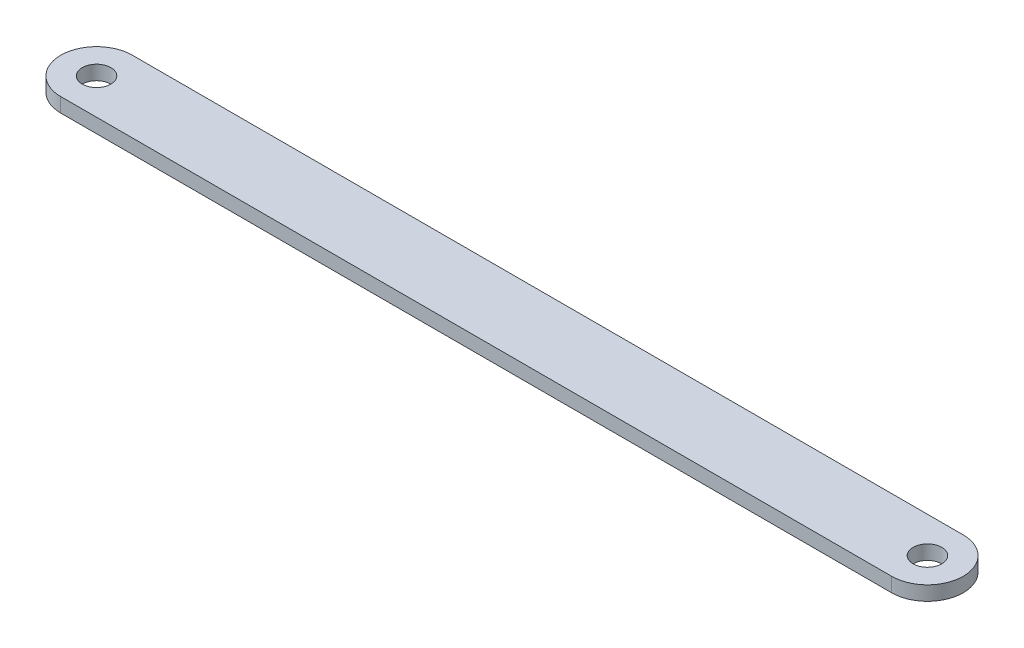
ISO-10303-21;
HEADER;
FILE_DESCRIPTION(('STEP AP214'),'2;1');
FILE_NAME('part.step','',(''),(''),'','','');
FILE_SCHEMA(('AUTOMOTIVE_DESIGN { 1 0 10303 214 1 1 1 1 }'));
ENDSEC;
DATA;
#1=APPLICATION_CONTEXT('core data for automotive mechanical design processes');
#2=APPLICATION_PROTOCOL_DEFINITION('international standard','automotive_design',2000,#1);
#3=PRODUCT_CONTEXT('',#1,'mechanical');
#4=PRODUCT('Part','Part','',(#3));
#5=PRODUCT_RELATED_PRODUCT_CATEGORY('part','',(#4));
#6=PRODUCT_DEFINITION_FORMATION('','',#4);
#7=PRODUCT_DEFINITION_CONTEXT('part definition',#1,'design');
#8=PRODUCT_DEFINITION('design','',#6,#7);
#9=PRODUCT_DEFINITION_SHAPE('','',#8);
#10=(LENGTH_UNIT() NAMED_UNIT(*) SI_UNIT(.MILLI.,.METRE.));
#11=(NAMED_UNIT(*) PLANE_ANGLE_UNIT() SI_UNIT($,.RADIAN.));
#12=(NAMED_UNIT(*) SI_UNIT($,.STERADIAN.) SOLID_ANGLE_UNIT());
#13=UNCERTAINTY_MEASURE_WITH_UNIT(LENGTH_MEASURE(1.E-05),#10,'distance_accuracy_value','');
#14=(GEOMETRIC_REPRESENTATION_CONTEXT(3) GLOBAL_UNCERTAINTY_ASSIGNED_CONTEXT((#13)) GLOBAL_UNIT_ASSIGNED_CONTEXT((#10,
#11,#12)) REPRESENTATION_CONTEXT('',''));
#15=CARTESIAN_POINT('',(0.,0.,0.));
#16=DIRECTION('',(0.,0.,1.));
#17=DIRECTION('',(1.,0.,0.));
#18=AXIS2_PLACEMENT_3D('',#15,#16,#17);
#19=CARTESIAN_POINT('',(-58.,2.,0.));
#20=DIRECTION('',(0.,1.,0.));
#21=DIRECTION('',(0.,0.,1.));
#22=AXIS2_PLACEMENT_3D('',#19,#20,#21);
#23=PLANE('',#22);
#24=CARTESIAN_POINT('',(-58.,2.,0.));
#25=DIRECTION('',(0.,1.,0.));
#26=DIRECTION('',(0.,0.,1.));
#27=AXIS2_PLACEMENT_3D('',#24,#25,#26);
#28=CIRCLE('',#27,2.);
#29=CARTESIAN_POINT('',(-58.,2.,2.));
#30=VERTEX_POINT('',#29);
#31=EDGE_CURVE('E116',#30,#30,#28,.T.);
#32=ORIENTED_EDGE('',*,*,#31,.F.);
#33=EDGE_LOOP('',(#32));
#34=FACE_BOUND('',#33,.T.);
#35=CARTESIAN_POINT('',(-58.,2.,0.));
#36=DIRECTION('',(0.,1.,0.));
#37=DIRECTION('',(0.,0.,1.));
#38=AXIS2_PLACEMENT_3D('',#35,#36,#37);
#39=CIRCLE('',#38,5.);
#40=CARTESIAN_POINT('',(-58.,2.,-5.));
#41=VERTEX_POINT('',#40);
#42=CARTESIAN_POINT('',(-58.,2.,5.));
#43=VERTEX_POINT('',#42);
#44=EDGE_CURVE('E96',#41,#43,#39,.T.);
#45=ORIENTED_EDGE('',*,*,#44,.T.);
#46=DIRECTION('',(1.,0.,0.));
#47=VECTOR('',#46,1.);
#48=CARTESIAN_POINT('',(-58.,2.,5.));
#49=LINE('',#48,#47);
#50=CARTESIAN_POINT('',(58.,2.,4.99999999999998));
#51=VERTEX_POINT('',#50);
#52=EDGE_CURVE('E91',#43,#51,#49,.T.);
#53=ORIENTED_EDGE('',*,*,#52,.T.);
#54=CARTESIAN_POINT('',(58.,2.,0.));
#55=DIRECTION('',(0.,1.,0.));
#56=DIRECTION('',(0.,0.,1.));
#57=AXIS2_PLACEMENT_3D('',#54,#55,#56);
#58=CIRCLE('',#57,5.);
#59=CARTESIAN_POINT('',(58.,2.,-5.00000000000002));
#60=VERTEX_POINT('',#59);
#61=EDGE_CURVE('E94',#51,#60,#58,.T.);
#62=ORIENTED_EDGE('',*,*,#61,.T.);
#63=DIRECTION('',(-1.,0.,0.));
#64=VECTOR('',#63,1.);
#65=CARTESIAN_POINT('',(-58.,2.,-5.));
#66=LINE('',#65,#64);
#67=EDGE_CURVE('E61',#60,#41,#66,.T.);
#68=ORIENTED_EDGE('',*,*,#67,.T.);
#69=EDGE_LOOP('',(#45,#53,#62,#68));
#70=FACE_BOUND('',#69,.T.);
#71=CARTESIAN_POINT('',(58.,2.,0.));
#72=DIRECTION('',(0.,1.,0.));
#73=DIRECTION('',(0.,0.,1.));
#74=AXIS2_PLACEMENT_3D('',#71,#72,#73);
#75=CIRCLE('',#74,2.);
#76=CARTESIAN_POINT('',(58.,2.,1.99999999999997));
#77=VERTEX_POINT('',#76);
#78=EDGE_CURVE('E138',#77,#77,#75,.T.);
#79=ORIENTED_EDGE('',*,*,#78,.F.);
#80=EDGE_LOOP('',(#79));
#81=FACE_BOUND('',#80,.T.);
#82=ADVANCED_FACE('F43',(#34,#70,#81),#23,.T.);
#83=CARTESIAN_POINT('',(-58.,0.,0.));
#84=DIRECTION('',(0.,1.,0.));
#85=DIRECTION('',(0.,0.,1.));
#86=AXIS2_PLACEMENT_3D('',#83,#84,#85);
#87=PLANE('',#86);
#88=CARTESIAN_POINT('',(-58.,0.,0.));
#89=DIRECTION('',(0.,1.,0.));
#90=DIRECTION('',(0.,0.,1.));
#91=AXIS2_PLACEMENT_3D('',#88,#89,#90);
#92=CIRCLE('',#91,5.);
#93=CARTESIAN_POINT('',(-58.,0.,-5.));
#94=VERTEX_POINT('',#93);
#95=CARTESIAN_POINT('',(-58.,0.,5.));
#96=VERTEX_POINT('',#95);
#97=EDGE_CURVE('E112',#94,#96,#92,.T.);
#98=ORIENTED_EDGE('',*,*,#97,.F.);
#99=DIRECTION('',(-1.,0.,0.));
#100=VECTOR('',#99,1.);
#101=CARTESIAN_POINT('',(-58.,0.,-5.));
#102=LINE('',#101,#100);
#103=CARTESIAN_POINT('',(58.,0.,-5.00000000000002));
#104=VERTEX_POINT('',#103);
#105=EDGE_CURVE('E84',#104,#94,#102,.T.);
#106=ORIENTED_EDGE('',*,*,#105,.F.);
#107=CARTESIAN_POINT('',(58.,0.,0.));
#108=DIRECTION('',(0.,1.,0.));
#109=DIRECTION('',(0.,0.,1.));
#110=AXIS2_PLACEMENT_3D('',#107,#108,#109);
#111=CIRCLE('',#110,5.);
#112=CARTESIAN_POINT('',(58.,0.,4.99999999999998));
#113=VERTEX_POINT('',#112);
#114=EDGE_CURVE('E78',#113,#104,#111,.T.);
#115=ORIENTED_EDGE('',*,*,#114,.F.);
#116=DIRECTION('',(1.,0.,0.));
#117=VECTOR('',#116,1.);
#118=CARTESIAN_POINT('',(-58.,0.,5.));
#119=LINE('',#118,#117);
#120=EDGE_CURVE('E101',#96,#113,#119,.T.);
#121=ORIENTED_EDGE('',*,*,#120,.F.);
#122=EDGE_LOOP('',(#98,#106,#115,#121));
#123=FACE_BOUND('',#122,.T.);
#124=CARTESIAN_POINT('',(-58.,0.,0.));
#125=DIRECTION('',(0.,1.,0.));
#126=DIRECTION('',(0.,0.,1.));
#127=AXIS2_PLACEMENT_3D('',#124,#125,#126);
#128=CIRCLE('',#127,2.);
#129=CARTESIAN_POINT('',(-58.,0.,2.));
#130=VERTEX_POINT('',#129);
#131=EDGE_CURVE('E134',#130,#130,#128,.T.);
#132=ORIENTED_EDGE('',*,*,#131,.T.);
#133=EDGE_LOOP('',(#132));
#134=FACE_BOUND('',#133,.T.);
#135=CARTESIAN_POINT('',(58.,0.,0.));
#136=DIRECTION('',(0.,1.,0.));
#137=DIRECTION('',(0.,0.,1.));
#138=AXIS2_PLACEMENT_3D('',#135,#136,#137);
#139=CIRCLE('',#138,2.);
#140=CARTESIAN_POINT('',(58.,0.,1.99999999999997));
#141=VERTEX_POINT('',#140);
#142=EDGE_CURVE('E142',#141,#141,#139,.T.);
#143=ORIENTED_EDGE('',*,*,#142,.T.);
#144=EDGE_LOOP('',(#143));
#145=FACE_BOUND('',#144,.T.);
#146=ADVANCED_FACE('F129',(#123,#134,#145),#87,.F.);
#147=CARTESIAN_POINT('',(-58.,2.,0.));
#148=DIRECTION('',(0.,-1.,0.));
#149=DIRECTION('',(0.,0.,-1.));
#150=AXIS2_PLACEMENT_3D('',#147,#148,#149);
#151=CYLINDRICAL_SURFACE('',#150,5.);
#152=ORIENTED_EDGE('',*,*,#97,.T.);
#153=DIRECTION('',(0.,-1.,0.));
#154=VECTOR('',#153,1.);
#155=CARTESIAN_POINT('',(-58.,2.,5.));
#156=LINE('',#155,#154);
#157=EDGE_CURVE('E11',#43,#96,#156,.T.);
#158=ORIENTED_EDGE('',*,*,#157,.F.);
#159=ORIENTED_EDGE('',*,*,#44,.F.);
#160=DIRECTION('',(0.,-1.,0.));
#161=VECTOR('',#160,1.);
#162=CARTESIAN_POINT('',(-58.,2.,-5.));
#163=LINE('',#162,#161);
#164=EDGE_CURVE('E108',#41,#94,#163,.T.);
#165=ORIENTED_EDGE('',*,*,#164,.T.);
#166=EDGE_LOOP('',(#152,#158,#159,#165));
#167=FACE_BOUND('',#166,.T.);
#168=ADVANCED_FACE('F45',(#167),#151,.T.);
#169=CARTESIAN_POINT('',(-58.,2.,5.));
#170=DIRECTION('',(0.,0.,-1.));
#171=DIRECTION('',(-1.,0.,0.));
#172=AXIS2_PLACEMENT_3D('',#169,#170,#171);
#173=PLANE('',#172);
#174=ORIENTED_EDGE('',*,*,#120,.T.);
#175=DIRECTION('',(0.,-1.,0.));
#176=VECTOR('',#175,1.);
#177=CARTESIAN_POINT('',(58.,2.,4.99999999999998));
#178=LINE('',#177,#176);
#179=EDGE_CURVE('E53',#51,#113,#178,.T.);
#180=ORIENTED_EDGE('',*,*,#179,.F.);
#181=ORIENTED_EDGE('',*,*,#52,.F.);
#182=ORIENTED_EDGE('',*,*,#157,.T.);
#183=EDGE_LOOP('',(#174,#180,#181,#182));
#184=FACE_BOUND('',#183,.T.);
#185=ADVANCED_FACE('F100',(#184),#173,.F.);
#186=CARTESIAN_POINT('',(58.,2.,0.));
#187=DIRECTION('',(0.,-1.,0.));
#188=DIRECTION('',(0.,0.,-1.));
#189=AXIS2_PLACEMENT_3D('',#186,#187,#188);
#190=CYLINDRICAL_SURFACE('',#189,5.);
#191=ORIENTED_EDGE('',*,*,#114,.T.);
#192=DIRECTION('',(0.,-1.,0.));
#193=VECTOR('',#192,1.);
#194=CARTESIAN_POINT('',(58.,2.,-5.00000000000002));
#195=LINE('',#194,#193);
#196=EDGE_CURVE('E103',#60,#104,#195,.T.);
#197=ORIENTED_EDGE('',*,*,#196,.F.);
#198=ORIENTED_EDGE('',*,*,#61,.F.);
#199=ORIENTED_EDGE('',*,*,#179,.T.);
#200=EDGE_LOOP('',(#191,#197,#198,#199));
#201=FACE_BOUND('',#200,.T.);
#202=ADVANCED_FACE('F104',(#201),#190,.T.);
#203=CARTESIAN_POINT('',(-58.,2.,-5.));
#204=DIRECTION('',(0.,0.,1.));
#205=DIRECTION('',(1.,0.,0.));
#206=AXIS2_PLACEMENT_3D('',#203,#204,#205);
#207=PLANE('',#206);
#208=ORIENTED_EDGE('',*,*,#105,.T.);
#209=ORIENTED_EDGE('',*,*,#164,.F.);
#210=ORIENTED_EDGE('',*,*,#67,.F.);
#211=ORIENTED_EDGE('',*,*,#196,.T.);
#212=EDGE_LOOP('',(#208,#209,#210,#211));
#213=FACE_BOUND('',#212,.T.);
#214=ADVANCED_FACE('F126',(#213),#207,.F.);
#215=CARTESIAN_POINT('',(-58.,2.,0.));
#216=DIRECTION('',(0.,-1.,0.));
#217=DIRECTION('',(0.,0.,-1.));
#218=AXIS2_PLACEMENT_3D('',#215,#216,#217);
#219=CYLINDRICAL_SURFACE('',#218,2.);
#220=ORIENTED_EDGE('',*,*,#31,.T.);
#221=EDGE_LOOP('',(#220));
#222=FACE_BOUND('',#221,.T.);
#223=ORIENTED_EDGE('',*,*,#131,.F.);
#224=EDGE_LOOP('',(#223));
#225=FACE_BOUND('',#224,.T.);
#226=ADVANCED_FACE('F161',(#222,#225),#219,.F.);
#227=CARTESIAN_POINT('',(58.,2.,0.));
#228=DIRECTION('',(0.,-1.,0.));
#229=DIRECTION('',(0.,0.,-1.));
#230=AXIS2_PLACEMENT_3D('',#227,#228,#229);
#231=CYLINDRICAL_SURFACE('',#230,2.);
#232=ORIENTED_EDGE('',*,*,#78,.T.);
#233=EDGE_LOOP('',(#232));
#234=FACE_BOUND('',#233,.T.);
#235=ORIENTED_EDGE('',*,*,#142,.F.);
#236=EDGE_LOOP('',(#235));
#237=FACE_BOUND('',#236,.T.);
#238=ADVANCED_FACE('F150',(#234,#237),#231,.F.);
#239=CLOSED_SHELL('',(#82,#146,#168,#185,#202,#214,#226,#238));
#240=MANIFOLD_SOLID_BREP('B2',#239);
#241=ADVANCED_BREP_SHAPE_REPRESENTATION('',(#18,#240),#14);
#242=SHAPE_DEFINITION_REPRESENTATION(#9,#241);
ENDSEC;
END-ISO-10303-21;
